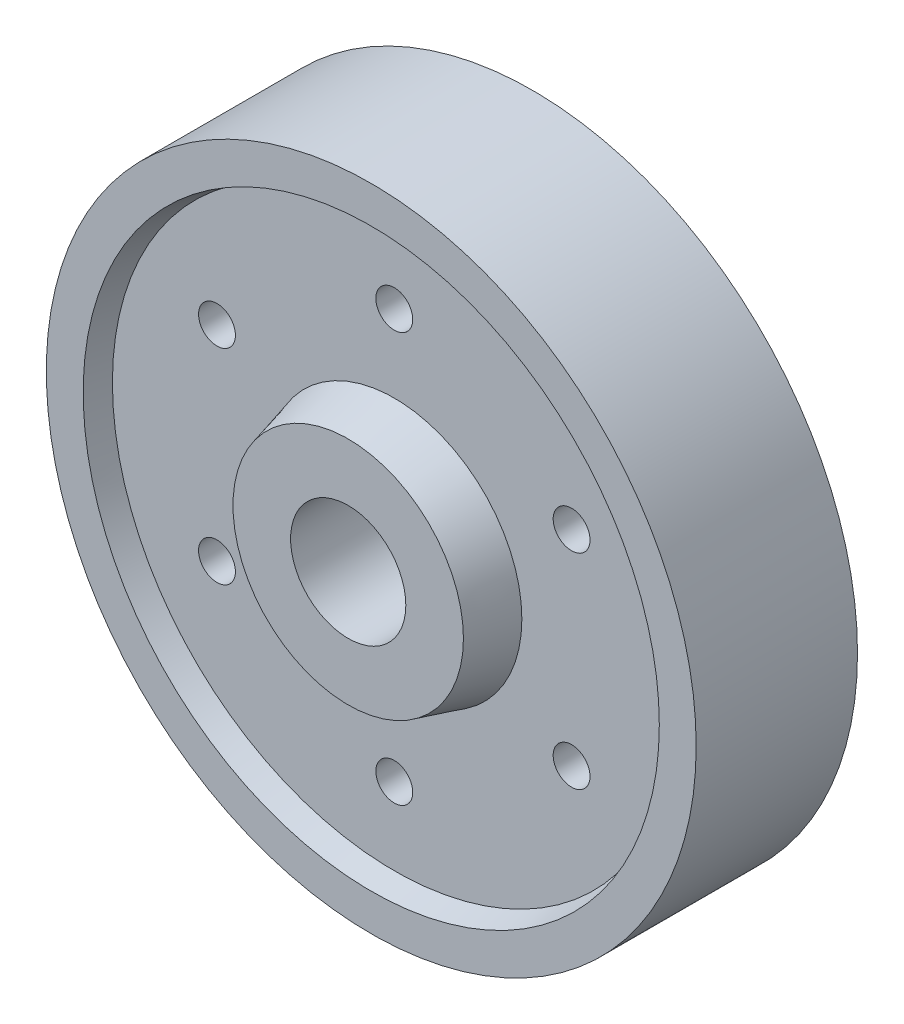
ISO-10303-21;
HEADER;
FILE_DESCRIPTION(('STEP AP214'),'2;1');
FILE_NAME('part.step','',(''),(''),'','','');
FILE_SCHEMA(('AUTOMOTIVE_DESIGN { 1 0 10303 214 1 1 1 1 }'));
ENDSEC;
DATA;
#1=APPLICATION_CONTEXT('core data for automotive mechanical design processes');
#2=APPLICATION_PROTOCOL_DEFINITION('international standard','automotive_design',2000,#1);
#3=PRODUCT_CONTEXT('',#1,'mechanical');
#4=PRODUCT('Part','Part','',(#3));
#5=PRODUCT_RELATED_PRODUCT_CATEGORY('part','',(#4));
#6=PRODUCT_DEFINITION_FORMATION('','',#4);
#7=PRODUCT_DEFINITION_CONTEXT('part definition',#1,'design');
#8=PRODUCT_DEFINITION('design','',#6,#7);
#9=PRODUCT_DEFINITION_SHAPE('','',#8);
#10=(LENGTH_UNIT() NAMED_UNIT(*) SI_UNIT(.MILLI.,.METRE.));
#11=(NAMED_UNIT(*) PLANE_ANGLE_UNIT() SI_UNIT($,.RADIAN.));
#12=(NAMED_UNIT(*) SI_UNIT($,.STERADIAN.) SOLID_ANGLE_UNIT());
#13=UNCERTAINTY_MEASURE_WITH_UNIT(LENGTH_MEASURE(1.E-05),#10,'distance_accuracy_value','');
#14=(GEOMETRIC_REPRESENTATION_CONTEXT(3) GLOBAL_UNCERTAINTY_ASSIGNED_CONTEXT((#13)) GLOBAL_UNIT_ASSIGNED_CONTEXT((#10,
#11,#12)) REPRESENTATION_CONTEXT('',''));
#15=CARTESIAN_POINT('',(0.,0.,0.));
#16=DIRECTION('',(0.,0.,1.));
#17=DIRECTION('',(1.,0.,0.));
#18=AXIS2_PLACEMENT_3D('',#15,#16,#17);
#19=CARTESIAN_POINT('',(0.,27.6794919243112,12.5));
#20=DIRECTION('',(0.,0.,-1.));
#21=DIRECTION('',(-1.,0.,0.));
#22=AXIS2_PLACEMENT_3D('',#19,#20,#21);
#23=PLANE('',#22);
#24=CARTESIAN_POINT('',(0.,44.4198729810778,12.5));
#25=DIRECTION('',(0.,0.,1.));
#26=DIRECTION('',(1.,0.,0.));
#27=AXIS2_PLACEMENT_3D('',#24,#25,#26);
#28=CIRCLE('',#27,4.);
#29=CARTESIAN_POINT('',(4.,44.4198729810778,12.5));
#30=VERTEX_POINT('',#29);
#31=EDGE_CURVE('E105',#30,#30,#28,.T.);
#32=ORIENTED_EDGE('',*,*,#31,.F.);
#33=EDGE_LOOP('',(#32));
#34=FACE_BOUND('',#33,.T.);
#35=CARTESIAN_POINT('',(-38.4687384344911,22.2099364905393,12.5));
#36=DIRECTION('',(0.,0.,1.));
#37=DIRECTION('',(1.,0.,0.));
#38=AXIS2_PLACEMENT_3D('',#35,#36,#37);
#39=CIRCLE('',#38,4.);
#40=CARTESIAN_POINT('',(-34.4687384344911,22.2099364905393,12.5));
#41=VERTEX_POINT('',#40);
#42=EDGE_CURVE('E89',#41,#41,#39,.T.);
#43=ORIENTED_EDGE('',*,*,#42,.F.);
#44=EDGE_LOOP('',(#43));
#45=FACE_BOUND('',#44,.T.);
#46=CARTESIAN_POINT('',(-3.10182315174431E-13,-44.4198729810778,12.5));
#47=DIRECTION('',(0.,0.,1.));
#48=DIRECTION('',(1.,0.,0.));
#49=AXIS2_PLACEMENT_3D('',#46,#47,#48);
#50=CIRCLE('',#49,4.);
#51=CARTESIAN_POINT('',(3.99999999999969,-44.4198729810778,12.5));
#52=VERTEX_POINT('',#51);
#53=EDGE_CURVE('E90',#52,#52,#50,.T.);
#54=ORIENTED_EDGE('',*,*,#53,.F.);
#55=EDGE_LOOP('',(#54));
#56=FACE_BOUND('',#55,.T.);
#57=CARTESIAN_POINT('',(38.4687384344913,-22.2099364905391,12.5));
#58=DIRECTION('',(0.,0.,1.));
#59=DIRECTION('',(1.,0.,0.));
#60=AXIS2_PLACEMENT_3D('',#57,#58,#59);
#61=CIRCLE('',#60,4.);
#62=CARTESIAN_POINT('',(42.4687384344913,-22.2099364905391,12.5));
#63=VERTEX_POINT('',#62);
#64=EDGE_CURVE('E96',#63,#63,#61,.T.);
#65=ORIENTED_EDGE('',*,*,#64,.F.);
#66=EDGE_LOOP('',(#65));
#67=FACE_BOUND('',#66,.T.);
#68=CARTESIAN_POINT('',(38.4687384344914,22.2099364905388,12.5));
#69=DIRECTION('',(0.,0.,1.));
#70=DIRECTION('',(1.,0.,0.));
#71=AXIS2_PLACEMENT_3D('',#68,#69,#70);
#72=CIRCLE('',#71,4.00000000000001);
#73=CARTESIAN_POINT('',(42.4687384344914,22.2099364905388,12.5));
#74=VERTEX_POINT('',#73);
#75=EDGE_CURVE('E102',#74,#74,#72,.T.);
#76=ORIENTED_EDGE('',*,*,#75,.F.);
#77=EDGE_LOOP('',(#76));
#78=FACE_BOUND('',#77,.T.);
#79=CARTESIAN_POINT('',(0.,0.,12.5));
#80=DIRECTION('',(0.,0.,1.));
#81=DIRECTION('',(1.,0.,0.));
#82=AXIS2_PLACEMENT_3D('',#79,#80,#81);
#83=CIRCLE('',#82,27.6794919243112);
#84=CARTESIAN_POINT('',(27.6794919243112,0.,12.5));
#85=VERTEX_POINT('',#84);
#86=EDGE_CURVE('E44',#85,#85,#83,.T.);
#87=ORIENTED_EDGE('',*,*,#86,.F.);
#88=EDGE_LOOP('',(#87));
#89=FACE_BOUND('',#88,.T.);
#90=CARTESIAN_POINT('',(0.,0.,12.5));
#91=DIRECTION('',(0.,0.,1.));
#92=DIRECTION('',(1.,0.,0.));
#93=AXIS2_PLACEMENT_3D('',#90,#91,#92);
#94=CIRCLE('',#93,61.1602540378444);
#95=CARTESIAN_POINT('',(61.1602540378444,0.,12.5));
#96=VERTEX_POINT('',#95);
#97=EDGE_CURVE('E48',#96,#96,#94,.T.);
#98=ORIENTED_EDGE('',*,*,#97,.T.);
#99=EDGE_LOOP('',(#98));
#100=FACE_BOUND('',#99,.T.);
#101=CARTESIAN_POINT('',(-38.4687384344916,-22.2099364905385,12.5));
#102=DIRECTION('',(0.,0.,1.));
#103=DIRECTION('',(1.,0.,0.));
#104=AXIS2_PLACEMENT_3D('',#101,#102,#103);
#105=CIRCLE('',#104,4.);
#106=CARTESIAN_POINT('',(-34.4687384344916,-22.2099364905385,12.5));
#107=VERTEX_POINT('',#106);
#108=EDGE_CURVE('E82',#107,#107,#105,.T.);
#109=ORIENTED_EDGE('',*,*,#108,.F.);
#110=EDGE_LOOP('',(#109));
#111=FACE_BOUND('',#110,.T.);
#112=ADVANCED_FACE('F37',(#34,#45,#56,#67,#78,#89,#100,#111),#23,.F.);
#113=CARTESIAN_POINT('',(0.,27.6794919243112,-12.5));
#114=DIRECTION('',(0.,0.,1.));
#115=DIRECTION('',(1.,0.,0.));
#116=AXIS2_PLACEMENT_3D('',#113,#114,#115);
#117=PLANE('',#116);
#118=CARTESIAN_POINT('',(0.,44.4198729810778,-12.5));
#119=DIRECTION('',(0.,0.,1.));
#120=DIRECTION('',(1.,0.,0.));
#121=AXIS2_PLACEMENT_3D('',#118,#119,#120);
#122=CIRCLE('',#121,4.);
#123=CARTESIAN_POINT('',(4.,44.4198729810778,-12.5));
#124=VERTEX_POINT('',#123);
#125=EDGE_CURVE('E81',#124,#124,#122,.F.);
#126=ORIENTED_EDGE('',*,*,#125,.F.);
#127=EDGE_LOOP('',(#126));
#128=FACE_BOUND('',#127,.T.);
#129=CARTESIAN_POINT('',(-38.4687384344911,22.2099364905393,-12.5));
#130=DIRECTION('',(0.,0.,1.));
#131=DIRECTION('',(1.,0.,0.));
#132=AXIS2_PLACEMENT_3D('',#129,#130,#131);
#133=CIRCLE('',#132,4.);
#134=CARTESIAN_POINT('',(-34.4687384344911,22.2099364905393,-12.5));
#135=VERTEX_POINT('',#134);
#136=EDGE_CURVE('E110',#135,#135,#133,.F.);
#137=ORIENTED_EDGE('',*,*,#136,.F.);
#138=EDGE_LOOP('',(#137));
#139=FACE_BOUND('',#138,.T.);
#140=CARTESIAN_POINT('',(-3.10182315174431E-13,-44.4198729810778,-12.5));
#141=DIRECTION('',(0.,0.,1.));
#142=DIRECTION('',(1.,0.,0.));
#143=AXIS2_PLACEMENT_3D('',#140,#141,#142);
#144=CIRCLE('',#143,4.);
#145=CARTESIAN_POINT('',(3.99999999999969,-44.4198729810778,-12.5));
#146=VERTEX_POINT('',#145);
#147=EDGE_CURVE('E85',#146,#146,#144,.F.);
#148=ORIENTED_EDGE('',*,*,#147,.F.);
#149=EDGE_LOOP('',(#148));
#150=FACE_BOUND('',#149,.T.);
#151=CARTESIAN_POINT('',(38.4687384344913,-22.2099364905391,-12.5));
#152=DIRECTION('',(0.,0.,1.));
#153=DIRECTION('',(1.,0.,0.));
#154=AXIS2_PLACEMENT_3D('',#151,#152,#153);
#155=CIRCLE('',#154,4.);
#156=CARTESIAN_POINT('',(42.4687384344913,-22.2099364905391,-12.5));
#157=VERTEX_POINT('',#156);
#158=EDGE_CURVE('E93',#157,#157,#155,.F.);
#159=ORIENTED_EDGE('',*,*,#158,.F.);
#160=EDGE_LOOP('',(#159));
#161=FACE_BOUND('',#160,.T.);
#162=CARTESIAN_POINT('',(38.4687384344914,22.2099364905388,-12.5));
#163=DIRECTION('',(0.,0.,1.));
#164=DIRECTION('',(1.,0.,0.));
#165=AXIS2_PLACEMENT_3D('',#162,#163,#164);
#166=CIRCLE('',#165,4.00000000000001);
#167=CARTESIAN_POINT('',(42.4687384344914,22.2099364905388,-12.5));
#168=VERTEX_POINT('',#167);
#169=EDGE_CURVE('E99',#168,#168,#166,.F.);
#170=ORIENTED_EDGE('',*,*,#169,.F.);
#171=EDGE_LOOP('',(#170));
#172=FACE_BOUND('',#171,.T.);
#173=CARTESIAN_POINT('',(0.,0.,-12.5));
#174=DIRECTION('',(0.,0.,1.));
#175=DIRECTION('',(1.,0.,0.));
#176=AXIS2_PLACEMENT_3D('',#173,#174,#175);
#177=CIRCLE('',#176,61.1602540378444);
#178=CARTESIAN_POINT('',(61.1602540378444,0.,-12.5));
#179=VERTEX_POINT('',#178);
#180=EDGE_CURVE('E66',#179,#179,#177,.T.);
#181=ORIENTED_EDGE('',*,*,#180,.F.);
#182=EDGE_LOOP('',(#181));
#183=FACE_BOUND('',#182,.T.);
#184=CARTESIAN_POINT('',(0.,0.,-12.5));
#185=DIRECTION('',(0.,0.,1.));
#186=DIRECTION('',(1.,0.,0.));
#187=AXIS2_PLACEMENT_3D('',#184,#185,#186);
#188=CIRCLE('',#187,27.6794919243112);
#189=CARTESIAN_POINT('',(27.6794919243112,0.,-12.5));
#190=VERTEX_POINT('',#189);
#191=EDGE_CURVE('E69',#190,#190,#188,.T.);
#192=ORIENTED_EDGE('',*,*,#191,.T.);
#193=EDGE_LOOP('',(#192));
#194=FACE_BOUND('',#193,.T.);
#195=CARTESIAN_POINT('',(-38.4687384344916,-22.2099364905385,-12.5));
#196=DIRECTION('',(0.,0.,1.));
#197=DIRECTION('',(1.,0.,0.));
#198=AXIS2_PLACEMENT_3D('',#195,#196,#197);
#199=CIRCLE('',#198,4.);
#200=CARTESIAN_POINT('',(-34.4687384344916,-22.2099364905385,-12.5));
#201=VERTEX_POINT('',#200);
#202=EDGE_CURVE('E86',#201,#201,#199,.F.);
#203=ORIENTED_EDGE('',*,*,#202,.F.);
#204=EDGE_LOOP('',(#203));
#205=FACE_BOUND('',#204,.T.);
#206=ADVANCED_FACE('F123',(#128,#139,#150,#161,#172,#183,#194,#205),#117,.F.);
#207=CARTESIAN_POINT('',(0.,12.5,22.5));
#208=DIRECTION('',(0.,0.,-1.));
#209=DIRECTION('',(-1.,0.,0.));
#210=AXIS2_PLACEMENT_3D('',#207,#208,#209);
#211=PLANE('',#210);
#212=CARTESIAN_POINT('',(0.,0.,22.5));
#213=DIRECTION('',(0.,0.,1.));
#214=DIRECTION('',(1.,0.,0.));
#215=AXIS2_PLACEMENT_3D('',#212,#213,#214);
#216=CIRCLE('',#215,12.5);
#217=CARTESIAN_POINT('',(12.5,0.,22.5));
#218=VERTEX_POINT('',#217);
#219=EDGE_CURVE('E78',#218,#218,#216,.T.);
#220=ORIENTED_EDGE('',*,*,#219,.F.);
#221=EDGE_LOOP('',(#220));
#222=FACE_BOUND('',#221,.T.);
#223=CARTESIAN_POINT('',(0.,0.,22.5));
#224=DIRECTION('',(0.,0.,1.));
#225=DIRECTION('',(1.,0.,0.));
#226=AXIS2_PLACEMENT_3D('',#223,#224,#225);
#227=CIRCLE('',#226,25.);
#228=CARTESIAN_POINT('',(25.,0.,22.5));
#229=VERTEX_POINT('',#228);
#230=EDGE_CURVE('E10',#229,#229,#227,.T.);
#231=ORIENTED_EDGE('',*,*,#230,.T.);
#232=EDGE_LOOP('',(#231));
#233=FACE_BOUND('',#232,.T.);
#234=ADVANCED_FACE('F39',(#222,#233),#211,.F.);
#235=CARTESIAN_POINT('',(0.,0.,12.5));
#236=DIRECTION('',(0.,0.,-1.));
#237=DIRECTION('',(-1.,0.,0.));
#238=AXIS2_PLACEMENT_3D('',#235,#236,#237);
#239=CONICAL_SURFACE('',#238,27.6794919243112,0.261799387799143);
#240=ORIENTED_EDGE('',*,*,#230,.F.);
#241=EDGE_LOOP('',(#240));
#242=FACE_BOUND('',#241,.T.);
#243=ORIENTED_EDGE('',*,*,#86,.T.);
#244=EDGE_LOOP('',(#243));
#245=FACE_BOUND('',#244,.T.);
#246=ADVANCED_FACE('F151',(#242,#245),#239,.T.);
#247=CARTESIAN_POINT('',(0.,0.,17.5));
#248=DIRECTION('',(0.,0.,1.));
#249=DIRECTION('',(1.,0.,0.));
#250=AXIS2_PLACEMENT_3D('',#247,#248,#249);
#251=CONICAL_SURFACE('',#250,62.5,0.26179938779914);
#252=ORIENTED_EDGE('',*,*,#97,.F.);
#253=EDGE_LOOP('',(#252));
#254=FACE_BOUND('',#253,.T.);
#255=CARTESIAN_POINT('',(0.,0.,17.5));
#256=DIRECTION('',(0.,0.,1.));
#257=DIRECTION('',(1.,0.,0.));
#258=AXIS2_PLACEMENT_3D('',#255,#256,#257);
#259=CIRCLE('',#258,62.5);
#260=CARTESIAN_POINT('',(62.5,0.,17.5));
#261=VERTEX_POINT('',#260);
#262=EDGE_CURVE('E52',#261,#261,#259,.T.);
#263=ORIENTED_EDGE('',*,*,#262,.T.);
#264=EDGE_LOOP('',(#263));
#265=FACE_BOUND('',#264,.T.);
#266=ADVANCED_FACE('F174',(#254,#265),#251,.F.);
#267=CARTESIAN_POINT('',(0.,62.5,17.5));
#268=DIRECTION('',(0.,0.,-1.));
#269=DIRECTION('',(-1.,0.,0.));
#270=AXIS2_PLACEMENT_3D('',#267,#268,#269);
#271=PLANE('',#270);
#272=ORIENTED_EDGE('',*,*,#262,.F.);
#273=EDGE_LOOP('',(#272));
#274=FACE_BOUND('',#273,.T.);
#275=CARTESIAN_POINT('',(0.,0.,17.5));
#276=DIRECTION('',(0.,0.,1.));
#277=DIRECTION('',(1.,0.,0.));
#278=AXIS2_PLACEMENT_3D('',#275,#276,#277);
#279=CIRCLE('',#278,70.5);
#280=CARTESIAN_POINT('',(70.5,0.,17.5));
#281=VERTEX_POINT('',#280);
#282=EDGE_CURVE('E57',#281,#281,#279,.T.);
#283=ORIENTED_EDGE('',*,*,#282,.T.);
#284=EDGE_LOOP('',(#283));
#285=FACE_BOUND('',#284,.T.);
#286=ADVANCED_FACE('F170',(#274,#285),#271,.F.);
#287=CARTESIAN_POINT('',(0.,0.,62.2654799248474));
#288=DIRECTION('',(0.,0.,1.));
#289=DIRECTION('',(1.,0.,0.));
#290=AXIS2_PLACEMENT_3D('',#287,#288,#289);
#291=CYLINDRICAL_SURFACE('',#290,70.5);
#292=ORIENTED_EDGE('',*,*,#282,.F.);
#293=EDGE_LOOP('',(#292));
#294=FACE_BOUND('',#293,.T.);
#295=CARTESIAN_POINT('',(0.,0.,-17.5));
#296=DIRECTION('',(0.,0.,1.));
#297=DIRECTION('',(1.,0.,0.));
#298=AXIS2_PLACEMENT_3D('',#295,#296,#297);
#299=CIRCLE('',#298,70.5);
#300=CARTESIAN_POINT('',(70.5,0.,-17.5));
#301=VERTEX_POINT('',#300);
#302=EDGE_CURVE('E60',#301,#301,#299,.T.);
#303=ORIENTED_EDGE('',*,*,#302,.T.);
#304=EDGE_LOOP('',(#303));
#305=FACE_BOUND('',#304,.T.);
#306=ADVANCED_FACE('F166',(#294,#305),#291,.T.);
#307=CARTESIAN_POINT('',(0.,62.5,-17.5));
#308=DIRECTION('',(0.,0.,1.));
#309=DIRECTION('',(1.,0.,0.));
#310=AXIS2_PLACEMENT_3D('',#307,#308,#309);
#311=PLANE('',#310);
#312=ORIENTED_EDGE('',*,*,#302,.F.);
#313=EDGE_LOOP('',(#312));
#314=FACE_BOUND('',#313,.T.);
#315=CARTESIAN_POINT('',(0.,0.,-17.5));
#316=DIRECTION('',(0.,0.,1.));
#317=DIRECTION('',(1.,0.,0.));
#318=AXIS2_PLACEMENT_3D('',#315,#316,#317);
#319=CIRCLE('',#318,62.5);
#320=CARTESIAN_POINT('',(62.5,0.,-17.5));
#321=VERTEX_POINT('',#320);
#322=EDGE_CURVE('E63',#321,#321,#319,.T.);
#323=ORIENTED_EDGE('',*,*,#322,.T.);
#324=EDGE_LOOP('',(#323));
#325=FACE_BOUND('',#324,.T.);
#326=ADVANCED_FACE('F162',(#314,#325),#311,.F.);
#327=CARTESIAN_POINT('',(0.,0.,-12.5));
#328=DIRECTION('',(0.,0.,-1.));
#329=DIRECTION('',(-1.,0.,0.));
#330=AXIS2_PLACEMENT_3D('',#327,#328,#329);
#331=CONICAL_SURFACE('',#330,61.1602540378444,0.26179938779914);
#332=ORIENTED_EDGE('',*,*,#322,.F.);
#333=EDGE_LOOP('',(#332));
#334=FACE_BOUND('',#333,.T.);
#335=ORIENTED_EDGE('',*,*,#180,.T.);
#336=EDGE_LOOP('',(#335));
#337=FACE_BOUND('',#336,.T.);
#338=ADVANCED_FACE('F159',(#334,#337),#331,.F.);
#339=CARTESIAN_POINT('',(0.,0.,-22.5));
#340=DIRECTION('',(0.,0.,1.));
#341=DIRECTION('',(1.,0.,0.));
#342=AXIS2_PLACEMENT_3D('',#339,#340,#341);
#343=CONICAL_SURFACE('',#342,25.,0.261799387799143);
#344=ORIENTED_EDGE('',*,*,#191,.F.);
#345=EDGE_LOOP('',(#344));
#346=FACE_BOUND('',#345,.T.);
#347=CARTESIAN_POINT('',(0.,0.,-22.5));
#348=DIRECTION('',(0.,0.,1.));
#349=DIRECTION('',(1.,0.,0.));
#350=AXIS2_PLACEMENT_3D('',#347,#348,#349);
#351=CIRCLE('',#350,25.);
#352=CARTESIAN_POINT('',(25.,0.,-22.5));
#353=VERTEX_POINT('',#352);
#354=EDGE_CURVE('E72',#353,#353,#351,.T.);
#355=ORIENTED_EDGE('',*,*,#354,.T.);
#356=EDGE_LOOP('',(#355));
#357=FACE_BOUND('',#356,.T.);
#358=ADVANCED_FACE('F157',(#346,#357),#343,.T.);
#359=CARTESIAN_POINT('',(0.,12.5,-22.5));
#360=DIRECTION('',(0.,0.,1.));
#361=DIRECTION('',(1.,0.,0.));
#362=AXIS2_PLACEMENT_3D('',#359,#360,#361);
#363=PLANE('',#362);
#364=ORIENTED_EDGE('',*,*,#354,.F.);
#365=EDGE_LOOP('',(#364));
#366=FACE_BOUND('',#365,.T.);
#367=CARTESIAN_POINT('',(0.,0.,-22.5));
#368=DIRECTION('',(0.,0.,1.));
#369=DIRECTION('',(1.,0.,0.));
#370=AXIS2_PLACEMENT_3D('',#367,#368,#369);
#371=CIRCLE('',#370,12.5);
#372=CARTESIAN_POINT('',(12.5,0.,-22.5));
#373=VERTEX_POINT('',#372);
#374=EDGE_CURVE('E75',#373,#373,#371,.T.);
#375=ORIENTED_EDGE('',*,*,#374,.T.);
#376=EDGE_LOOP('',(#375));
#377=FACE_BOUND('',#376,.T.);
#378=ADVANCED_FACE('F216',(#366,#377),#363,.F.);
#379=CARTESIAN_POINT('',(0.,0.,62.2654799248474));
#380=DIRECTION('',(0.,0.,1.));
#381=DIRECTION('',(1.,0.,0.));
#382=AXIS2_PLACEMENT_3D('',#379,#380,#381);
#383=CYLINDRICAL_SURFACE('',#382,12.5);
#384=ORIENTED_EDGE('',*,*,#374,.F.);
#385=EDGE_LOOP('',(#384));
#386=FACE_BOUND('',#385,.T.);
#387=ORIENTED_EDGE('',*,*,#219,.T.);
#388=EDGE_LOOP('',(#387));
#389=FACE_BOUND('',#388,.T.);
#390=ADVANCED_FACE('F224',(#386,#389),#383,.F.);
#391=CARTESIAN_POINT('',(38.4687384344914,22.2099364905388,-22.501));
#392=DIRECTION('',(0.,0.,1.));
#393=DIRECTION('',(1.,0.,0.));
#394=AXIS2_PLACEMENT_3D('',#391,#392,#393);
#395=CYLINDRICAL_SURFACE('',#394,4.00000000000001);
#396=ORIENTED_EDGE('',*,*,#75,.T.);
#397=EDGE_LOOP('',(#396));
#398=FACE_BOUND('',#397,.T.);
#399=ORIENTED_EDGE('',*,*,#169,.T.);
#400=EDGE_LOOP('',(#399));
#401=FACE_BOUND('',#400,.T.);
#402=ADVANCED_FACE('F231',(#398,#401),#395,.F.);
#403=CARTESIAN_POINT('',(38.4687384344913,-22.2099364905391,-22.501));
#404=DIRECTION('',(0.,0.,1.));
#405=DIRECTION('',(1.,0.,0.));
#406=AXIS2_PLACEMENT_3D('',#403,#404,#405);
#407=CYLINDRICAL_SURFACE('',#406,4.);
#408=ORIENTED_EDGE('',*,*,#64,.T.);
#409=EDGE_LOOP('',(#408));
#410=FACE_BOUND('',#409,.T.);
#411=ORIENTED_EDGE('',*,*,#158,.T.);
#412=EDGE_LOOP('',(#411));
#413=FACE_BOUND('',#412,.T.);
#414=ADVANCED_FACE('F249',(#410,#413),#407,.F.);
#415=CARTESIAN_POINT('',(-3.10182315174431E-13,-44.4198729810778,-22.501));
#416=DIRECTION('',(0.,0.,1.));
#417=DIRECTION('',(1.,0.,0.));
#418=AXIS2_PLACEMENT_3D('',#415,#416,#417);
#419=CYLINDRICAL_SURFACE('',#418,4.);
#420=ORIENTED_EDGE('',*,*,#53,.T.);
#421=EDGE_LOOP('',(#420));
#422=FACE_BOUND('',#421,.T.);
#423=ORIENTED_EDGE('',*,*,#147,.T.);
#424=EDGE_LOOP('',(#423));
#425=FACE_BOUND('',#424,.T.);
#426=ADVANCED_FACE('F258',(#422,#425),#419,.F.);
#427=CARTESIAN_POINT('',(-38.4687384344911,22.2099364905393,-22.501));
#428=DIRECTION('',(0.,0.,1.));
#429=DIRECTION('',(1.,0.,0.));
#430=AXIS2_PLACEMENT_3D('',#427,#428,#429);
#431=CYLINDRICAL_SURFACE('',#430,4.);
#432=ORIENTED_EDGE('',*,*,#42,.T.);
#433=EDGE_LOOP('',(#432));
#434=FACE_BOUND('',#433,.T.);
#435=ORIENTED_EDGE('',*,*,#136,.T.);
#436=EDGE_LOOP('',(#435));
#437=FACE_BOUND('',#436,.T.);
#438=ADVANCED_FACE('F267',(#434,#437),#431,.F.);
#439=CARTESIAN_POINT('',(0.,44.4198729810778,-22.501));
#440=DIRECTION('',(0.,0.,1.));
#441=DIRECTION('',(1.,0.,0.));
#442=AXIS2_PLACEMENT_3D('',#439,#440,#441);
#443=CYLINDRICAL_SURFACE('',#442,4.);
#444=ORIENTED_EDGE('',*,*,#31,.T.);
#445=EDGE_LOOP('',(#444));
#446=FACE_BOUND('',#445,.T.);
#447=ORIENTED_EDGE('',*,*,#125,.T.);
#448=EDGE_LOOP('',(#447));
#449=FACE_BOUND('',#448,.T.);
#450=ADVANCED_FACE('F118',(#446,#449),#443,.F.);
#451=CARTESIAN_POINT('',(-38.4687384344916,-22.2099364905385,-22.501));
#452=DIRECTION('',(0.,0.,1.));
#453=DIRECTION('',(1.,0.,0.));
#454=AXIS2_PLACEMENT_3D('',#451,#452,#453);
#455=CYLINDRICAL_SURFACE('',#454,4.);
#456=ORIENTED_EDGE('',*,*,#108,.T.);
#457=EDGE_LOOP('',(#456));
#458=FACE_BOUND('',#457,.T.);
#459=ORIENTED_EDGE('',*,*,#202,.T.);
#460=EDGE_LOOP('',(#459));
#461=FACE_BOUND('',#460,.T.);
#462=ADVANCED_FACE('F138',(#458,#461),#455,.F.);
#463=CLOSED_SHELL('',(#112,#206,#234,#246,#266,#286,#306,#326,#338,#358,#378,#390,#402,#414,
#426,#438,#450,#462));
#464=MANIFOLD_SOLID_BREP('B2',#463);
#465=ADVANCED_BREP_SHAPE_REPRESENTATION('',(#18,#464),#14);
#466=SHAPE_DEFINITION_REPRESENTATION(#9,#465);
ENDSEC;
END-ISO-10303-21;
